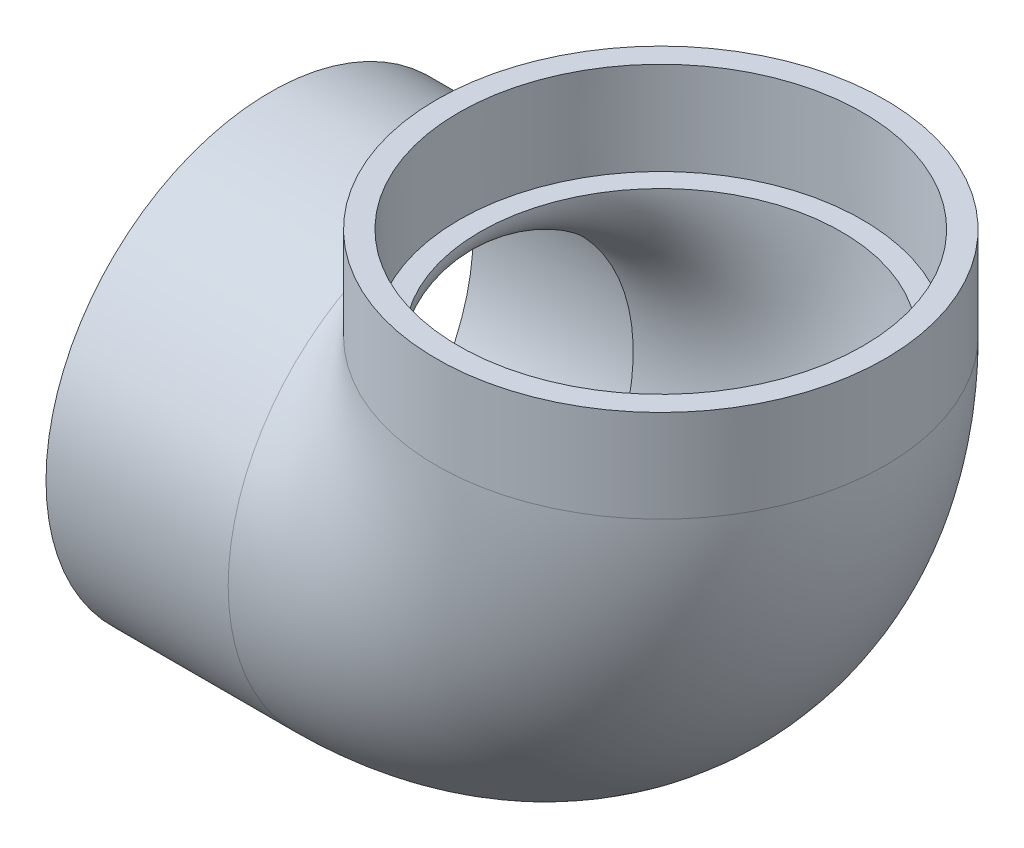
ISO-10303-21;
HEADER;
FILE_DESCRIPTION(('STEP AP214'),'2;1');
FILE_NAME('part.step','',(''),(''),'','','');
FILE_SCHEMA(('AUTOMOTIVE_DESIGN { 1 0 10303 214 1 1 1 1 }'));
ENDSEC;
DATA;
#1=APPLICATION_CONTEXT('core data for automotive mechanical design processes');
#2=APPLICATION_PROTOCOL_DEFINITION('international standard','automotive_design',2000,#1);
#3=PRODUCT_CONTEXT('',#1,'mechanical');
#4=PRODUCT('Part','Part','',(#3));
#5=PRODUCT_RELATED_PRODUCT_CATEGORY('part','',(#4));
#6=PRODUCT_DEFINITION_FORMATION('','',#4);
#7=PRODUCT_DEFINITION_CONTEXT('part definition',#1,'design');
#8=PRODUCT_DEFINITION('design','',#6,#7);
#9=PRODUCT_DEFINITION_SHAPE('','',#8);
#10=(LENGTH_UNIT() NAMED_UNIT(*) SI_UNIT(.MILLI.,.METRE.));
#11=(NAMED_UNIT(*) PLANE_ANGLE_UNIT() SI_UNIT($,.RADIAN.));
#12=(NAMED_UNIT(*) SI_UNIT($,.STERADIAN.) SOLID_ANGLE_UNIT());
#13=UNCERTAINTY_MEASURE_WITH_UNIT(LENGTH_MEASURE(1.E-05),#10,'distance_accuracy_value','');
#14=(GEOMETRIC_REPRESENTATION_CONTEXT(3) GLOBAL_UNCERTAINTY_ASSIGNED_CONTEXT((#13)) GLOBAL_UNIT_ASSIGNED_CONTEXT((#10,
#11,#12)) REPRESENTATION_CONTEXT('',''));
#15=CARTESIAN_POINT('',(0.,0.,0.));
#16=DIRECTION('',(0.,0.,1.));
#17=DIRECTION('',(1.,0.,0.));
#18=AXIS2_PLACEMENT_3D('',#15,#16,#17);
#19=CARTESIAN_POINT('',(0.,0.,0.));
#20=DIRECTION('',(0.,-1.,0.));
#21=DIRECTION('',(0.,0.,-1.));
#22=AXIS2_PLACEMENT_3D('',#19,#20,#21);
#23=CYLINDRICAL_SURFACE('',#22,63.5);
#24=CARTESIAN_POINT('',(0.,58.9279999999999,0.));
#25=DIRECTION('',(0.,1.,0.));
#26=DIRECTION('',(0.,0.,-1.));
#27=AXIS2_PLACEMENT_3D('',#24,#25,#26);
#28=CIRCLE('',#27,63.5);
#29=CARTESIAN_POINT('',(-58.9279999999999,58.9279999999999,23.6588422370989));
#30=VERTEX_POINT('',#29);
#31=CARTESIAN_POINT('',(-58.9279999999999,58.9279999999999,-23.6588422371016));
#32=VERTEX_POINT('',#31);
#33=EDGE_CURVE('E60',#30,#32,#28,.T.);
#34=ORIENTED_EDGE('',*,*,#33,.T.);
#35=CARTESIAN_POINT('',(0.,0.,0.));
#36=DIRECTION('',(-0.707106781186547,-0.707106781186547,0.));
#37=DIRECTION('',(-0.707106781186547,0.707106781186547,0.));
#38=AXIS2_PLACEMENT_3D('',#35,#36,#37);
#39=ELLIPSE('',#38,89.8025612106915,63.5);
#40=EDGE_CURVE('E66',#32,#30,#39,.F.);
#41=ORIENTED_EDGE('',*,*,#40,.T.);
#42=EDGE_LOOP('',(#34,#41));
#43=FACE_BOUND('',#42,.T.);
#44=CARTESIAN_POINT('',(0.,85.0900000000009,0.));
#45=DIRECTION('',(0.,1.,0.));
#46=DIRECTION('',(-1.,0.,0.));
#47=AXIS2_PLACEMENT_3D('',#44,#45,#46);
#48=CIRCLE('',#47,63.5);
#49=CARTESIAN_POINT('',(-63.5,85.0900000000009,0.));
#50=VERTEX_POINT('',#49);
#51=EDGE_CURVE('E184',#50,#50,#48,.T.);
#52=ORIENTED_EDGE('',*,*,#51,.F.);
#53=EDGE_LOOP('',(#52));
#54=FACE_BOUND('',#53,.T.);
#55=ADVANCED_FACE('F45',(#43,#54),#23,.T.);
#56=CARTESIAN_POINT('',(0.,110.49,0.));
#57=DIRECTION('',(0.,1.,0.));
#58=DIRECTION('',(0.,0.,1.));
#59=AXIS2_PLACEMENT_3D('',#56,#57,#58);
#60=CONICAL_SURFACE('',#59,57.3786,0.0066501482705858);
#61=CARTESIAN_POINT('',(0.,58.9279999999999,0.));
#62=DIRECTION('',(0.,1.,0.));
#63=DIRECTION('',(-1.,0.,0.));
#64=AXIS2_PLACEMENT_3D('',#61,#62,#63);
#65=CIRCLE('',#64,57.0357);
#66=CARTESIAN_POINT('',(-57.0357,58.9279999999999,-1.13980225258103E-13));
#67=VERTEX_POINT('',#66);
#68=EDGE_CURVE('E13',#67,#67,#65,.F.);
#69=ORIENTED_EDGE('',*,*,#68,.T.);
#70=EDGE_LOOP('',(#69));
#71=FACE_BOUND('',#70,.T.);
#72=CARTESIAN_POINT('',(0.,85.0900000000009,0.));
#73=DIRECTION('',(0.,1.,0.));
#74=DIRECTION('',(-1.,0.,0.));
#75=AXIS2_PLACEMENT_3D('',#72,#73,#74);
#76=CIRCLE('',#75,57.2096837438424);
#77=CARTESIAN_POINT('',(-57.2096837438424,85.0900000000009,0.));
#78=VERTEX_POINT('',#77);
#79=EDGE_CURVE('E49',#78,#78,#76,.T.);
#80=ORIENTED_EDGE('',*,*,#79,.T.);
#81=EDGE_LOOP('',(#80));
#82=FACE_BOUND('',#81,.T.);
#83=ADVANCED_FACE('F91',(#71,#82),#60,.F.);
#84=CARTESIAN_POINT('',(-110.49,-63.4999999999999,-1.33226762955019E-12));
#85=DIRECTION('',(-1.,0.,0.));
#86=DIRECTION('',(0.,0.,1.));
#87=AXIS2_PLACEMENT_3D('',#84,#85,#86);
#88=PLANE('',#87);
#89=CARTESIAN_POINT('',(-110.49,0.,-1.33226762955019E-12));
#90=DIRECTION('',(-1.,0.,0.));
#91=DIRECTION('',(0.,0.,1.));
#92=AXIS2_PLACEMENT_3D('',#89,#90,#91);
#93=CIRCLE('',#92,63.5);
#94=CARTESIAN_POINT('',(-110.49,0.,63.4999999999987));
#95=VERTEX_POINT('',#94);
#96=EDGE_CURVE('E67',#95,#95,#93,.T.);
#97=ORIENTED_EDGE('',*,*,#96,.T.);
#98=EDGE_LOOP('',(#97));
#99=FACE_BOUND('',#98,.T.);
#100=CARTESIAN_POINT('',(-110.49,0.,-1.33226762955019E-12));
#101=DIRECTION('',(-1.,0.,0.));
#102=DIRECTION('',(0.,0.,1.));
#103=AXIS2_PLACEMENT_3D('',#100,#101,#102);
#104=CIRCLE('',#103,57.3786);
#105=CARTESIAN_POINT('',(-110.49,0.,57.3785999999987));
#106=VERTEX_POINT('',#105);
#107=EDGE_CURVE('E54',#106,#106,#104,.T.);
#108=ORIENTED_EDGE('',*,*,#107,.F.);
#109=EDGE_LOOP('',(#108));
#110=FACE_BOUND('',#109,.T.);
#111=ADVANCED_FACE('F47',(#99,#110),#88,.T.);
#112=CARTESIAN_POINT('',(-58.9279999999999,0.,-1.33226762955019E-12));
#113=DIRECTION('',(-1.,0.,0.));
#114=DIRECTION('',(0.,0.,1.));
#115=AXIS2_PLACEMENT_3D('',#112,#113,#114);
#116=CONICAL_SURFACE('',#115,57.0357,0.0066501482705858);
#117=ORIENTED_EDGE('',*,*,#107,.T.);
#118=EDGE_LOOP('',(#117));
#119=FACE_BOUND('',#118,.T.);
#120=CARTESIAN_POINT('',(-58.9279999999999,0.,-1.33226762955019E-12));
#121=DIRECTION('',(-1.,0.,0.));
#122=DIRECTION('',(0.,0.,1.));
#123=AXIS2_PLACEMENT_3D('',#120,#121,#122);
#124=CIRCLE('',#123,57.0357);
#125=CARTESIAN_POINT('',(-58.9279999999998,0.,57.0356999999987));
#126=VERTEX_POINT('',#125);
#127=EDGE_CURVE('E77',#126,#126,#124,.T.);
#128=ORIENTED_EDGE('',*,*,#127,.F.);
#129=EDGE_LOOP('',(#128));
#130=FACE_BOUND('',#129,.T.);
#131=ADVANCED_FACE('F87',(#119,#130),#116,.F.);
#132=CARTESIAN_POINT('',(-110.49,0.,-1.33226762955019E-12));
#133=DIRECTION('',(-1.,0.,0.));
#134=DIRECTION('',(0.,0.,1.));
#135=AXIS2_PLACEMENT_3D('',#132,#133,#134);
#136=CYLINDRICAL_SURFACE('',#135,63.5);
#137=ORIENTED_EDGE('',*,*,#40,.F.);
#138=CARTESIAN_POINT('',(-58.9279999999999,0.,-1.33226762955019E-12));
#139=DIRECTION('',(-1.,0.,0.));
#140=DIRECTION('',(0.,0.,1.));
#141=AXIS2_PLACEMENT_3D('',#138,#139,#140);
#142=CIRCLE('',#141,63.5);
#143=EDGE_CURVE('E73',#32,#30,#142,.T.);
#144=ORIENTED_EDGE('',*,*,#143,.T.);
#145=EDGE_LOOP('',(#137,#144));
#146=FACE_BOUND('',#145,.T.);
#147=ORIENTED_EDGE('',*,*,#96,.F.);
#148=EDGE_LOOP('',(#147));
#149=FACE_BOUND('',#148,.T.);
#150=ADVANCED_FACE('F71',(#146,#149),#136,.T.);
#151=CARTESIAN_POINT('',(-58.9279999999999,58.9279999999999,-1.33226762955019E-12));
#152=DIRECTION('',(0.,0.,-1.));
#153=DIRECTION('',(-1.,0.,0.));
#154=AXIS2_PLACEMENT_3D('',#151,#152,#153);
#155=TOROIDAL_SURFACE('',#154,58.928,51.1302);
#156=CARTESIAN_POINT('',(0.,58.9279999999999,0.));
#157=DIRECTION('',(0.,1.,0.));
#158=DIRECTION('',(0.,0.,-1.));
#159=AXIS2_PLACEMENT_3D('',#156,#157,#158);
#160=CIRCLE('',#159,51.1302);
#161=CARTESIAN_POINT('',(51.1302000000001,58.9279999999999,1.15597186995023E-12));
#162=VERTEX_POINT('',#161);
#163=EDGE_CURVE('E68',#162,#162,#160,.T.);
#164=CARTESIAN_POINT('',(-58.9279999999999,0.,-1.33226762955019E-12));
#165=DIRECTION('',(1.,0.,0.));
#166=DIRECTION('',(0.,0.,-1.));
#167=AXIS2_PLACEMENT_3D('',#164,#165,#166);
#168=CIRCLE('',#167,51.1302);
#169=CARTESIAN_POINT('',(-58.9279999999999,-51.1302000000001,-1.33226762955019E-12));
#170=VERTEX_POINT('',#169);
#171=EDGE_CURVE('E74',#170,#170,#168,.T.);
#172=CARTESIAN_POINT('',(-58.9279999999999,58.9279999999999,-1.33226762955019E-12));
#173=DIRECTION('',(0.,0.,-1.));
#174=DIRECTION('',(-1.,0.,0.));
#175=AXIS2_PLACEMENT_3D('',#172,#173,#174);
#176=CIRCLE('',#175,110.0582);
#177=EDGE_CURVE('',#162,#170,#176,.T.);
#178=ORIENTED_EDGE('',*,*,#163,.T.);
#179=ORIENTED_EDGE('',*,*,#171,.F.);
#180=ORIENTED_EDGE('',*,*,#177,.T.);
#181=ORIENTED_EDGE('',*,*,#177,.F.);
#182=EDGE_LOOP('',(#178,#180,#179,#181));
#183=FACE_BOUND('',#182,.T.);
#184=ADVANCED_FACE('F114',(#183),#155,.F.);
#185=CARTESIAN_POINT('',(-117.856,58.9279999999999,-1.45002942986139E-12));
#186=DIRECTION('',(0.,-1.,0.));
#187=DIRECTION('',(-1.,0.,0.));
#188=AXIS2_PLACEMENT_3D('',#185,#186,#187);
#189=CIRCLE('',#188,63.5);
#190=TRIMMED_CURVE('',#189,(PARAMETER_VALUE(-2.7598047993663)),
(PARAMETER_VALUE(2.7598047993663)),.T.,.PARAMETER.);
#191=CARTESIAN_POINT('',(-58.9279999999999,58.9279999999999,-1.33226762955019E-12));
#192=DIRECTION('',(0.,0.,-1.));
#193=AXIS1_PLACEMENT('',#191,#192);
#194=SURFACE_OF_REVOLUTION('',#190,#193);
#195=ORIENTED_EDGE('',*,*,#33,.F.);
#196=ORIENTED_EDGE('',*,*,#143,.F.);
#197=EDGE_LOOP('',(#195,#196));
#198=FACE_BOUND('',#197,.T.);
#199=ADVANCED_FACE('F76',(#198),#194,.T.);
#200=CARTESIAN_POINT('',(0.,58.9279999999999,0.));
#201=DIRECTION('',(0.,1.,0.));
#202=DIRECTION('',(0.,0.,-1.));
#203=AXIS2_PLACEMENT_3D('',#200,#201,#202);
#204=PLANE('',#203);
#205=ORIENTED_EDGE('',*,*,#68,.F.);
#206=EDGE_LOOP('',(#205));
#207=FACE_BOUND('',#206,.T.);
#208=ORIENTED_EDGE('',*,*,#163,.F.);
#209=EDGE_LOOP('',(#208));
#210=FACE_BOUND('',#209,.T.);
#211=ADVANCED_FACE('F109',(#207,#210),#204,.T.);
#212=CARTESIAN_POINT('',(-58.9279999999999,0.,-1.33226762955019E-12));
#213=DIRECTION('',(1.,0.,0.));
#214=DIRECTION('',(0.,0.,-1.));
#215=AXIS2_PLACEMENT_3D('',#212,#213,#214);
#216=PLANE('',#215);
#217=ORIENTED_EDGE('',*,*,#127,.T.);
#218=EDGE_LOOP('',(#217));
#219=FACE_BOUND('',#218,.T.);
#220=ORIENTED_EDGE('',*,*,#171,.T.);
#221=EDGE_LOOP('',(#220));
#222=FACE_BOUND('',#221,.T.);
#223=ADVANCED_FACE('F105',(#219,#222),#216,.F.);
#224=CARTESIAN_POINT('',(0.,85.0900000000009,0.));
#225=DIRECTION('',(0.,1.,0.));
#226=DIRECTION('',(-1.,0.,0.));
#227=AXIS2_PLACEMENT_3D('',#224,#225,#226);
#228=PLANE('',#227);
#229=ORIENTED_EDGE('',*,*,#79,.F.);
#230=EDGE_LOOP('',(#229));
#231=FACE_BOUND('',#230,.T.);
#232=ORIENTED_EDGE('',*,*,#51,.T.);
#233=EDGE_LOOP('',(#232));
#234=FACE_BOUND('',#233,.T.);
#235=ADVANCED_FACE('F108',(#231,#234),#228,.T.);
#236=CLOSED_SHELL('',(#55,#83,#111,#131,#150,#184,#199,#211,#223,#235));
#237=MANIFOLD_SOLID_BREP('B2',#236);
#238=ADVANCED_BREP_SHAPE_REPRESENTATION('',(#18,#237),#14);
#239=SHAPE_DEFINITION_REPRESENTATION(#9,#238);
ENDSEC;
END-ISO-10303-21;
